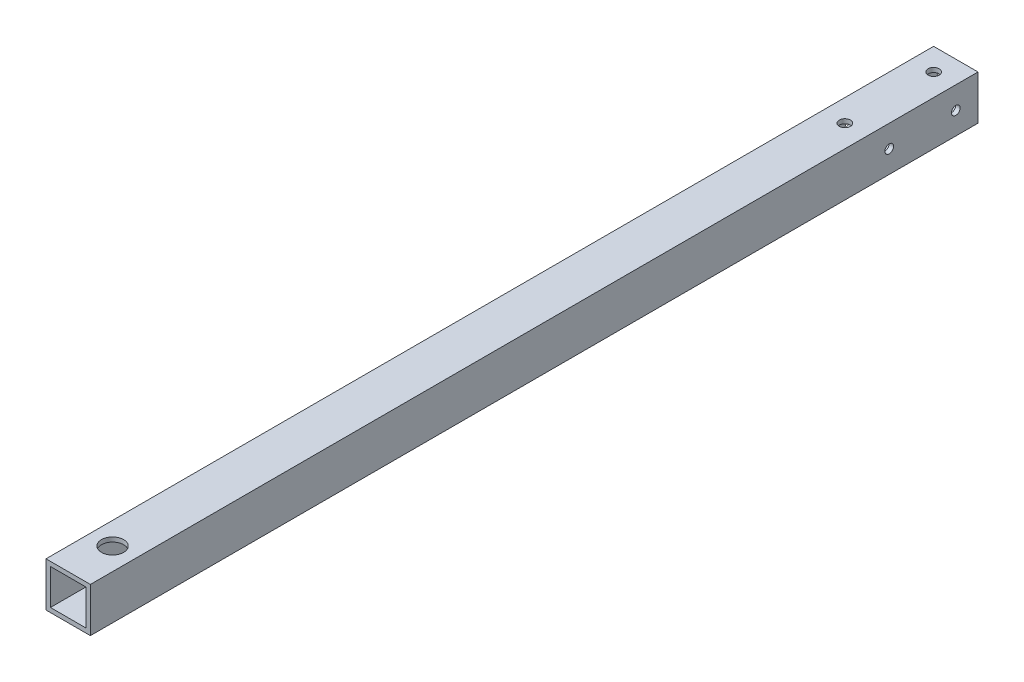
ISO-10303-21;
HEADER;
FILE_DESCRIPTION(('STEP AP214'),'2;1');
FILE_NAME('part.step','',(''),(''),'','','');
FILE_SCHEMA(('AUTOMOTIVE_DESIGN { 1 0 10303 214 1 1 1 1 }'));
ENDSEC;
DATA;
#1=APPLICATION_CONTEXT('core data for automotive mechanical design processes');
#2=APPLICATION_PROTOCOL_DEFINITION('international standard','automotive_design',2000,#1);
#3=PRODUCT_CONTEXT('',#1,'mechanical');
#4=PRODUCT('Part','Part','',(#3));
#5=PRODUCT_RELATED_PRODUCT_CATEGORY('part','',(#4));
#6=PRODUCT_DEFINITION_FORMATION('','',#4);
#7=PRODUCT_DEFINITION_CONTEXT('part definition',#1,'design');
#8=PRODUCT_DEFINITION('design','',#6,#7);
#9=PRODUCT_DEFINITION_SHAPE('','',#8);
#10=(LENGTH_UNIT() NAMED_UNIT(*) SI_UNIT(.MILLI.,.METRE.));
#11=(NAMED_UNIT(*) PLANE_ANGLE_UNIT() SI_UNIT($,.RADIAN.));
#12=(NAMED_UNIT(*) SI_UNIT($,.STERADIAN.) SOLID_ANGLE_UNIT());
#13=UNCERTAINTY_MEASURE_WITH_UNIT(LENGTH_MEASURE(1.E-05),#10,'distance_accuracy_value','');
#14=(GEOMETRIC_REPRESENTATION_CONTEXT(3) GLOBAL_UNCERTAINTY_ASSIGNED_CONTEXT((#13)) GLOBAL_UNIT_ASSIGNED_CONTEXT((#10,
#11,#12)) REPRESENTATION_CONTEXT('',''));
#15=CARTESIAN_POINT('',(0.,0.,0.));
#16=DIRECTION('',(0.,0.,1.));
#17=DIRECTION('',(1.,0.,0.));
#18=AXIS2_PLACEMENT_3D('',#15,#16,#17);
#19=CARTESIAN_POINT('',(-12.7,-12.7,254.));
#20=DIRECTION('',(-1.,0.,0.));
#21=DIRECTION('',(0.,0.,1.));
#22=AXIS2_PLACEMENT_3D('',#19,#20,#21);
#23=PLANE('',#22);
#24=CARTESIAN_POINT('',(-12.7,0.,-241.3));
#25=DIRECTION('',(-1.,0.,0.));
#26=DIRECTION('',(0.,0.,1.));
#27=AXIS2_PLACEMENT_3D('',#24,#25,#26);
#28=CIRCLE('',#27,2.4892);
#29=CARTESIAN_POINT('',(-12.7,0.,-238.8108));
#30=VERTEX_POINT('',#29);
#31=EDGE_CURVE('E208',#30,#30,#28,.T.);
#32=ORIENTED_EDGE('',*,*,#31,.F.);
#33=EDGE_LOOP('',(#32));
#34=FACE_BOUND('',#33,.T.);
#35=CARTESIAN_POINT('',(-12.7,0.,-203.2));
#36=DIRECTION('',(-1.,0.,0.));
#37=DIRECTION('',(0.,0.,1.));
#38=AXIS2_PLACEMENT_3D('',#35,#36,#37);
#39=CIRCLE('',#38,2.4892);
#40=CARTESIAN_POINT('',(-12.7,0.,-200.7108));
#41=VERTEX_POINT('',#40);
#42=EDGE_CURVE('E218',#41,#41,#39,.T.);
#43=ORIENTED_EDGE('',*,*,#42,.F.);
#44=EDGE_LOOP('',(#43));
#45=FACE_BOUND('',#44,.T.);
#46=DIRECTION('',(0.,1.,0.));
#47=VECTOR('',#46,1.);
#48=CARTESIAN_POINT('',(-12.7,-12.7,-254.));
#49=LINE('',#48,#47);
#50=CARTESIAN_POINT('',(-12.7,-12.7,-254.));
#51=VERTEX_POINT('',#50);
#52=CARTESIAN_POINT('',(-12.7,12.7,-254.));
#53=VERTEX_POINT('',#52);
#54=EDGE_CURVE('E157',#51,#53,#49,.T.);
#55=ORIENTED_EDGE('',*,*,#54,.F.);
#56=DIRECTION('',(0.,0.,-1.));
#57=VECTOR('',#56,1.);
#58=CARTESIAN_POINT('',(-12.7,-12.7,254.));
#59=LINE('',#58,#57);
#60=CARTESIAN_POINT('',(-12.7,-12.7,254.));
#61=VERTEX_POINT('',#60);
#62=EDGE_CURVE('E12',#61,#51,#59,.T.);
#63=ORIENTED_EDGE('',*,*,#62,.F.);
#64=DIRECTION('',(0.,1.,0.));
#65=VECTOR('',#64,1.);
#66=CARTESIAN_POINT('',(-12.7,-12.7,254.));
#67=LINE('',#66,#65);
#68=CARTESIAN_POINT('',(-12.7,12.7,254.));
#69=VERTEX_POINT('',#68);
#70=EDGE_CURVE('E161',#61,#69,#67,.T.);
#71=ORIENTED_EDGE('',*,*,#70,.T.);
#72=DIRECTION('',(0.,0.,-1.));
#73=VECTOR('',#72,1.);
#74=CARTESIAN_POINT('',(-12.7,12.7,254.));
#75=LINE('',#74,#73);
#76=EDGE_CURVE('E172',#69,#53,#75,.T.);
#77=ORIENTED_EDGE('',*,*,#76,.T.);
#78=EDGE_LOOP('',(#55,#63,#71,#77));
#79=FACE_BOUND('',#78,.T.);
#80=ADVANCED_FACE('F58',(#34,#45,#79),#23,.T.);
#81=CARTESIAN_POINT('',(-12.7,-12.7,254.));
#82=DIRECTION('',(0.,1.,0.));
#83=DIRECTION('',(0.,0.,1.));
#84=AXIS2_PLACEMENT_3D('',#81,#82,#83);
#85=PLANE('',#84);
#86=CARTESIAN_POINT('',(0.,-12.7,228.6));
#87=DIRECTION('',(0.,1.,0.));
#88=DIRECTION('',(0.,0.,1.));
#89=AXIS2_PLACEMENT_3D('',#86,#87,#88);
#90=CIRCLE('',#89,6.35);
#91=CARTESIAN_POINT('',(0.,-12.7,234.95));
#92=VERTEX_POINT('',#91);
#93=EDGE_CURVE('E198',#92,#92,#90,.T.);
#94=ORIENTED_EDGE('',*,*,#93,.T.);
#95=EDGE_LOOP('',(#94));
#96=FACE_BOUND('',#95,.T.);
#97=CARTESIAN_POINT('',(0.,-12.7,-241.3));
#98=DIRECTION('',(0.,1.,0.));
#99=DIRECTION('',(0.,0.,1.));
#100=AXIS2_PLACEMENT_3D('',#97,#98,#99);
#101=CIRCLE('',#100,3.175);
#102=CARTESIAN_POINT('',(0.,-12.7,-238.125));
#103=VERTEX_POINT('',#102);
#104=EDGE_CURVE('E191',#103,#103,#101,.T.);
#105=ORIENTED_EDGE('',*,*,#104,.T.);
#106=EDGE_LOOP('',(#105));
#107=FACE_BOUND('',#106,.T.);
#108=CARTESIAN_POINT('',(0.,-12.7,-190.5));
#109=DIRECTION('',(0.,1.,0.));
#110=DIRECTION('',(0.,0.,1.));
#111=AXIS2_PLACEMENT_3D('',#108,#109,#110);
#112=CIRCLE('',#111,3.175);
#113=CARTESIAN_POINT('',(0.,-12.7,-187.325));
#114=VERTEX_POINT('',#113);
#115=EDGE_CURVE('E237',#114,#114,#112,.T.);
#116=ORIENTED_EDGE('',*,*,#115,.T.);
#117=EDGE_LOOP('',(#116));
#118=FACE_BOUND('',#117,.T.);
#119=DIRECTION('',(1.,0.,0.));
#120=VECTOR('',#119,1.);
#121=CARTESIAN_POINT('',(-12.7,-12.7,-254.));
#122=LINE('',#121,#120);
#123=CARTESIAN_POINT('',(12.7,-12.7,-254.));
#124=VERTEX_POINT('',#123);
#125=EDGE_CURVE('E165',#51,#124,#122,.T.);
#126=ORIENTED_EDGE('',*,*,#125,.T.);
#127=DIRECTION('',(0.,0.,-1.));
#128=VECTOR('',#127,1.);
#129=CARTESIAN_POINT('',(12.7,-12.7,254.));
#130=LINE('',#129,#128);
#131=CARTESIAN_POINT('',(12.7,-12.7,254.));
#132=VERTEX_POINT('',#131);
#133=EDGE_CURVE('E66',#132,#124,#130,.T.);
#134=ORIENTED_EDGE('',*,*,#133,.F.);
#135=DIRECTION('',(1.,0.,0.));
#136=VECTOR('',#135,1.);
#137=CARTESIAN_POINT('',(-12.7,-12.7,254.));
#138=LINE('',#137,#136);
#139=EDGE_CURVE('E170',#61,#132,#138,.T.);
#140=ORIENTED_EDGE('',*,*,#139,.F.);
#141=ORIENTED_EDGE('',*,*,#62,.T.);
#142=EDGE_LOOP('',(#126,#134,#140,#141));
#143=FACE_BOUND('',#142,.T.);
#144=ADVANCED_FACE('F272',(#96,#107,#118,#143),#85,.F.);
#145=CARTESIAN_POINT('',(12.7,-12.7,254.));
#146=DIRECTION('',(-1.,0.,0.));
#147=DIRECTION('',(0.,0.,1.));
#148=AXIS2_PLACEMENT_3D('',#145,#146,#147);
#149=PLANE('',#148);
#150=CARTESIAN_POINT('',(12.7,0.,-241.3));
#151=DIRECTION('',(-1.,0.,0.));
#152=DIRECTION('',(0.,0.,1.));
#153=AXIS2_PLACEMENT_3D('',#150,#151,#152);
#154=CIRCLE('',#153,2.4892);
#155=CARTESIAN_POINT('',(12.7,0.,-238.8108));
#156=VERTEX_POINT('',#155);
#157=EDGE_CURVE('E202',#156,#156,#154,.T.);
#158=ORIENTED_EDGE('',*,*,#157,.T.);
#159=EDGE_LOOP('',(#158));
#160=FACE_BOUND('',#159,.T.);
#161=CARTESIAN_POINT('',(12.7,0.,-203.2));
#162=DIRECTION('',(-1.,0.,0.));
#163=DIRECTION('',(0.,0.,1.));
#164=AXIS2_PLACEMENT_3D('',#161,#162,#163);
#165=CIRCLE('',#164,2.4892);
#166=CARTESIAN_POINT('',(12.7,0.,-200.7108));
#167=VERTEX_POINT('',#166);
#168=EDGE_CURVE('E213',#167,#167,#165,.T.);
#169=ORIENTED_EDGE('',*,*,#168,.T.);
#170=EDGE_LOOP('',(#169));
#171=FACE_BOUND('',#170,.T.);
#172=DIRECTION('',(0.,1.,0.));
#173=VECTOR('',#172,1.);
#174=CARTESIAN_POINT('',(12.7,-12.7,-254.));
#175=LINE('',#174,#173);
#176=CARTESIAN_POINT('',(12.7,12.7,-254.));
#177=VERTEX_POINT('',#176);
#178=EDGE_CURVE('E178',#124,#177,#175,.T.);
#179=ORIENTED_EDGE('',*,*,#178,.T.);
#180=DIRECTION('',(0.,0.,-1.));
#181=VECTOR('',#180,1.);
#182=CARTESIAN_POINT('',(12.7,12.7,254.));
#183=LINE('',#182,#181);
#184=CARTESIAN_POINT('',(12.7,12.7,254.));
#185=VERTEX_POINT('',#184);
#186=EDGE_CURVE('E184',#185,#177,#183,.T.);
#187=ORIENTED_EDGE('',*,*,#186,.F.);
#188=DIRECTION('',(0.,1.,0.));
#189=VECTOR('',#188,1.);
#190=CARTESIAN_POINT('',(12.7,-12.7,254.));
#191=LINE('',#190,#189);
#192=EDGE_CURVE('E168',#132,#185,#191,.T.);
#193=ORIENTED_EDGE('',*,*,#192,.F.);
#194=ORIENTED_EDGE('',*,*,#133,.T.);
#195=EDGE_LOOP('',(#179,#187,#193,#194));
#196=FACE_BOUND('',#195,.T.);
#197=ADVANCED_FACE('F277',(#160,#171,#196),#149,.F.);
#198=CARTESIAN_POINT('',(-12.7,12.7,254.));
#199=DIRECTION('',(0.,1.,0.));
#200=DIRECTION('',(0.,0.,1.));
#201=AXIS2_PLACEMENT_3D('',#198,#199,#200);
#202=PLANE('',#201);
#203=CARTESIAN_POINT('',(0.,12.7,228.6));
#204=DIRECTION('',(0.,1.,0.));
#205=DIRECTION('',(0.,0.,1.));
#206=AXIS2_PLACEMENT_3D('',#203,#204,#205);
#207=CIRCLE('',#206,6.35);
#208=CARTESIAN_POINT('',(0.,12.7,234.95));
#209=VERTEX_POINT('',#208);
#210=EDGE_CURVE('E224',#209,#209,#207,.T.);
#211=ORIENTED_EDGE('',*,*,#210,.F.);
#212=EDGE_LOOP('',(#211));
#213=FACE_BOUND('',#212,.T.);
#214=CARTESIAN_POINT('',(0.,12.7,-241.3));
#215=DIRECTION('',(0.,1.,0.));
#216=DIRECTION('',(0.,0.,1.));
#217=AXIS2_PLACEMENT_3D('',#214,#215,#216);
#218=CIRCLE('',#217,3.175);
#219=CARTESIAN_POINT('',(0.,12.7,-238.125));
#220=VERTEX_POINT('',#219);
#221=EDGE_CURVE('E234',#220,#220,#218,.T.);
#222=ORIENTED_EDGE('',*,*,#221,.F.);
#223=EDGE_LOOP('',(#222));
#224=FACE_BOUND('',#223,.T.);
#225=CARTESIAN_POINT('',(0.,12.7,-190.5));
#226=DIRECTION('',(0.,1.,0.));
#227=DIRECTION('',(0.,0.,1.));
#228=AXIS2_PLACEMENT_3D('',#225,#226,#227);
#229=CIRCLE('',#228,3.175);
#230=CARTESIAN_POINT('',(0.,12.7,-187.325));
#231=VERTEX_POINT('',#230);
#232=EDGE_CURVE('E231',#231,#231,#229,.T.);
#233=ORIENTED_EDGE('',*,*,#232,.F.);
#234=EDGE_LOOP('',(#233));
#235=FACE_BOUND('',#234,.T.);
#236=DIRECTION('',(1.,0.,0.));
#237=VECTOR('',#236,1.);
#238=CARTESIAN_POINT('',(-12.7,12.7,-254.));
#239=LINE('',#238,#237);
#240=EDGE_CURVE('E175',#53,#177,#239,.T.);
#241=ORIENTED_EDGE('',*,*,#240,.F.);
#242=ORIENTED_EDGE('',*,*,#76,.F.);
#243=DIRECTION('',(1.,0.,0.));
#244=VECTOR('',#243,1.);
#245=CARTESIAN_POINT('',(-12.7,12.7,254.));
#246=LINE('',#245,#244);
#247=EDGE_CURVE('E164',#69,#185,#246,.T.);
#248=ORIENTED_EDGE('',*,*,#247,.T.);
#249=ORIENTED_EDGE('',*,*,#186,.T.);
#250=EDGE_LOOP('',(#241,#242,#248,#249));
#251=FACE_BOUND('',#250,.T.);
#252=ADVANCED_FACE('F297',(#213,#224,#235,#251),#202,.T.);
#253=CARTESIAN_POINT('',(0.,0.,254.));
#254=DIRECTION('',(0.,0.,-1.));
#255=DIRECTION('',(-1.,0.,0.));
#256=AXIS2_PLACEMENT_3D('',#253,#254,#255);
#257=PLANE('',#256);
#258=DIRECTION('',(1.,0.,0.));
#259=VECTOR('',#258,1.);
#260=CARTESIAN_POINT('',(0.,-10.16,254.));
#261=LINE('',#260,#259);
#262=CARTESIAN_POINT('',(-10.16,-10.16,254.));
#263=VERTEX_POINT('',#262);
#264=CARTESIAN_POINT('',(10.16,-10.16,254.));
#265=VERTEX_POINT('',#264);
#266=EDGE_CURVE('E128',#263,#265,#261,.T.);
#267=ORIENTED_EDGE('',*,*,#266,.F.);
#268=DIRECTION('',(0.,1.,0.));
#269=VECTOR('',#268,1.);
#270=CARTESIAN_POINT('',(-10.16,0.,254.));
#271=LINE('',#270,#269);
#272=CARTESIAN_POINT('',(-10.16,10.16,254.));
#273=VERTEX_POINT('',#272);
#274=EDGE_CURVE('E125',#263,#273,#271,.T.);
#275=ORIENTED_EDGE('',*,*,#274,.T.);
#276=DIRECTION('',(1.,0.,0.));
#277=VECTOR('',#276,1.);
#278=CARTESIAN_POINT('',(0.,10.16,254.));
#279=LINE('',#278,#277);
#280=CARTESIAN_POINT('',(10.16,10.16,254.));
#281=VERTEX_POINT('',#280);
#282=EDGE_CURVE('E131',#273,#281,#279,.T.);
#283=ORIENTED_EDGE('',*,*,#282,.T.);
#284=DIRECTION('',(0.,1.,0.));
#285=VECTOR('',#284,1.);
#286=CARTESIAN_POINT('',(10.16,0.,254.));
#287=LINE('',#286,#285);
#288=EDGE_CURVE('E135',#265,#281,#287,.T.);
#289=ORIENTED_EDGE('',*,*,#288,.F.);
#290=EDGE_LOOP('',(#267,#275,#283,#289));
#291=FACE_BOUND('',#290,.T.);
#292=ORIENTED_EDGE('',*,*,#70,.F.);
#293=ORIENTED_EDGE('',*,*,#139,.T.);
#294=ORIENTED_EDGE('',*,*,#192,.T.);
#295=ORIENTED_EDGE('',*,*,#247,.F.);
#296=EDGE_LOOP('',(#292,#293,#294,#295));
#297=FACE_BOUND('',#296,.T.);
#298=ADVANCED_FACE('F137',(#291,#297),#257,.F.);
#299=CARTESIAN_POINT('',(0.,0.,-254.));
#300=DIRECTION('',(0.,0.,-1.));
#301=DIRECTION('',(-1.,0.,0.));
#302=AXIS2_PLACEMENT_3D('',#299,#300,#301);
#303=PLANE('',#302);
#304=DIRECTION('',(0.,1.,0.));
#305=VECTOR('',#304,1.);
#306=CARTESIAN_POINT('',(-10.16,0.,-254.));
#307=LINE('',#306,#305);
#308=CARTESIAN_POINT('',(-10.16,-10.16,-254.));
#309=VERTEX_POINT('',#308);
#310=CARTESIAN_POINT('',(-10.16,10.16,-254.));
#311=VERTEX_POINT('',#310);
#312=EDGE_CURVE('E82',#309,#311,#307,.T.);
#313=ORIENTED_EDGE('',*,*,#312,.F.);
#314=DIRECTION('',(1.,0.,0.));
#315=VECTOR('',#314,1.);
#316=CARTESIAN_POINT('',(0.,-10.16,-254.));
#317=LINE('',#316,#315);
#318=CARTESIAN_POINT('',(10.16,-10.16,-254.));
#319=VERTEX_POINT('',#318);
#320=EDGE_CURVE('E139',#309,#319,#317,.T.);
#321=ORIENTED_EDGE('',*,*,#320,.T.);
#322=DIRECTION('',(0.,1.,0.));
#323=VECTOR('',#322,1.);
#324=CARTESIAN_POINT('',(10.16,0.,-254.));
#325=LINE('',#324,#323);
#326=CARTESIAN_POINT('',(10.16,10.16,-254.));
#327=VERTEX_POINT('',#326);
#328=EDGE_CURVE('E142',#319,#327,#325,.T.);
#329=ORIENTED_EDGE('',*,*,#328,.T.);
#330=DIRECTION('',(1.,0.,0.));
#331=VECTOR('',#330,1.);
#332=CARTESIAN_POINT('',(0.,10.16,-254.));
#333=LINE('',#332,#331);
#334=EDGE_CURVE('E151',#311,#327,#333,.T.);
#335=ORIENTED_EDGE('',*,*,#334,.F.);
#336=EDGE_LOOP('',(#313,#321,#329,#335));
#337=FACE_BOUND('',#336,.T.);
#338=ORIENTED_EDGE('',*,*,#54,.T.);
#339=ORIENTED_EDGE('',*,*,#240,.T.);
#340=ORIENTED_EDGE('',*,*,#178,.F.);
#341=ORIENTED_EDGE('',*,*,#125,.F.);
#342=EDGE_LOOP('',(#338,#339,#340,#341));
#343=FACE_BOUND('',#342,.T.);
#344=ADVANCED_FACE('F257',(#337,#343),#303,.T.);
#345=CARTESIAN_POINT('',(-10.16,0.,254.));
#346=DIRECTION('',(-1.,0.,0.));
#347=DIRECTION('',(0.,0.,1.));
#348=AXIS2_PLACEMENT_3D('',#345,#346,#347);
#349=PLANE('',#348);
#350=CARTESIAN_POINT('',(-10.16,0.,-241.3));
#351=DIRECTION('',(-1.,0.,0.));
#352=DIRECTION('',(0.,0.,1.));
#353=AXIS2_PLACEMENT_3D('',#350,#351,#352);
#354=CIRCLE('',#353,2.4892);
#355=CARTESIAN_POINT('',(-10.16,0.,-238.8108));
#356=VERTEX_POINT('',#355);
#357=EDGE_CURVE('E221',#356,#356,#354,.T.);
#358=ORIENTED_EDGE('',*,*,#357,.T.);
#359=EDGE_LOOP('',(#358));
#360=FACE_BOUND('',#359,.T.);
#361=CARTESIAN_POINT('',(-10.16,0.,-203.2));
#362=DIRECTION('',(-1.,0.,0.));
#363=DIRECTION('',(0.,0.,1.));
#364=AXIS2_PLACEMENT_3D('',#361,#362,#363);
#365=CIRCLE('',#364,2.4892);
#366=CARTESIAN_POINT('',(-10.16,0.,-200.7108));
#367=VERTEX_POINT('',#366);
#368=EDGE_CURVE('E201',#367,#367,#365,.T.);
#369=ORIENTED_EDGE('',*,*,#368,.T.);
#370=EDGE_LOOP('',(#369));
#371=FACE_BOUND('',#370,.T.);
#372=ORIENTED_EDGE('',*,*,#312,.T.);
#373=DIRECTION('',(0.,0.,-1.));
#374=VECTOR('',#373,1.);
#375=CARTESIAN_POINT('',(-10.16,10.16,254.));
#376=LINE('',#375,#374);
#377=EDGE_CURVE('E122',#273,#311,#376,.T.);
#378=ORIENTED_EDGE('',*,*,#377,.F.);
#379=ORIENTED_EDGE('',*,*,#274,.F.);
#380=DIRECTION('',(0.,0.,-1.));
#381=VECTOR('',#380,1.);
#382=CARTESIAN_POINT('',(-10.16,-10.16,254.));
#383=LINE('',#382,#381);
#384=EDGE_CURVE('E155',#263,#309,#383,.T.);
#385=ORIENTED_EDGE('',*,*,#384,.T.);
#386=EDGE_LOOP('',(#372,#378,#379,#385));
#387=FACE_BOUND('',#386,.T.);
#388=ADVANCED_FACE('F123',(#360,#371,#387),#349,.F.);
#389=CARTESIAN_POINT('',(0.,-10.16,254.));
#390=DIRECTION('',(0.,1.,0.));
#391=DIRECTION('',(0.,0.,1.));
#392=AXIS2_PLACEMENT_3D('',#389,#390,#391);
#393=PLANE('',#392);
#394=CARTESIAN_POINT('',(0.,-10.16,228.6));
#395=DIRECTION('',(0.,1.,0.));
#396=DIRECTION('',(0.,0.,1.));
#397=AXIS2_PLACEMENT_3D('',#394,#395,#396);
#398=CIRCLE('',#397,6.35);
#399=CARTESIAN_POINT('',(0.,-10.16,234.95));
#400=VERTEX_POINT('',#399);
#401=EDGE_CURVE('E197',#400,#400,#398,.T.);
#402=ORIENTED_EDGE('',*,*,#401,.F.);
#403=EDGE_LOOP('',(#402));
#404=FACE_BOUND('',#403,.T.);
#405=CARTESIAN_POINT('',(0.,-10.16,-241.3));
#406=DIRECTION('',(0.,1.,0.));
#407=DIRECTION('',(0.,0.,1.));
#408=AXIS2_PLACEMENT_3D('',#405,#406,#407);
#409=CIRCLE('',#408,3.175);
#410=CARTESIAN_POINT('',(0.,-10.16,-238.125));
#411=VERTEX_POINT('',#410);
#412=EDGE_CURVE('E145',#411,#411,#409,.T.);
#413=ORIENTED_EDGE('',*,*,#412,.F.);
#414=EDGE_LOOP('',(#413));
#415=FACE_BOUND('',#414,.T.);
#416=CARTESIAN_POINT('',(0.,-10.16,-190.5));
#417=DIRECTION('',(0.,1.,0.));
#418=DIRECTION('',(0.,0.,1.));
#419=AXIS2_PLACEMENT_3D('',#416,#417,#418);
#420=CIRCLE('',#419,3.175);
#421=CARTESIAN_POINT('',(0.,-10.16,-187.325));
#422=VERTEX_POINT('',#421);
#423=EDGE_CURVE('E190',#422,#422,#420,.T.);
#424=ORIENTED_EDGE('',*,*,#423,.F.);
#425=EDGE_LOOP('',(#424));
#426=FACE_BOUND('',#425,.T.);
#427=ORIENTED_EDGE('',*,*,#320,.F.);
#428=ORIENTED_EDGE('',*,*,#384,.F.);
#429=ORIENTED_EDGE('',*,*,#266,.T.);
#430=DIRECTION('',(0.,0.,-1.));
#431=VECTOR('',#430,1.);
#432=CARTESIAN_POINT('',(10.16,-10.16,254.));
#433=LINE('',#432,#431);
#434=EDGE_CURVE('E158',#265,#319,#433,.T.);
#435=ORIENTED_EDGE('',*,*,#434,.T.);
#436=EDGE_LOOP('',(#427,#428,#429,#435));
#437=FACE_BOUND('',#436,.T.);
#438=ADVANCED_FACE('F247',(#404,#415,#426,#437),#393,.T.);
#439=CARTESIAN_POINT('',(10.16,0.,254.));
#440=DIRECTION('',(-1.,0.,0.));
#441=DIRECTION('',(0.,0.,1.));
#442=AXIS2_PLACEMENT_3D('',#439,#440,#441);
#443=PLANE('',#442);
#444=CARTESIAN_POINT('',(10.16,0.,-241.3));
#445=DIRECTION('',(-1.,0.,0.));
#446=DIRECTION('',(0.,0.,1.));
#447=AXIS2_PLACEMENT_3D('',#444,#445,#446);
#448=CIRCLE('',#447,2.4892);
#449=CARTESIAN_POINT('',(10.16,0.,-238.8108));
#450=VERTEX_POINT('',#449);
#451=EDGE_CURVE('E61',#450,#450,#448,.T.);
#452=ORIENTED_EDGE('',*,*,#451,.F.);
#453=EDGE_LOOP('',(#452));
#454=FACE_BOUND('',#453,.T.);
#455=CARTESIAN_POINT('',(10.16,0.,-203.2));
#456=DIRECTION('',(-1.,0.,0.));
#457=DIRECTION('',(0.,0.,1.));
#458=AXIS2_PLACEMENT_3D('',#455,#456,#457);
#459=CIRCLE('',#458,2.4892);
#460=CARTESIAN_POINT('',(10.16,0.,-200.7108));
#461=VERTEX_POINT('',#460);
#462=EDGE_CURVE('E199',#461,#461,#459,.T.);
#463=ORIENTED_EDGE('',*,*,#462,.F.);
#464=EDGE_LOOP('',(#463));
#465=FACE_BOUND('',#464,.T.);
#466=ORIENTED_EDGE('',*,*,#328,.F.);
#467=ORIENTED_EDGE('',*,*,#434,.F.);
#468=ORIENTED_EDGE('',*,*,#288,.T.);
#469=DIRECTION('',(0.,0.,-1.));
#470=VECTOR('',#469,1.);
#471=CARTESIAN_POINT('',(10.16,10.16,254.));
#472=LINE('',#471,#470);
#473=EDGE_CURVE('E74',#281,#327,#472,.T.);
#474=ORIENTED_EDGE('',*,*,#473,.T.);
#475=EDGE_LOOP('',(#466,#467,#468,#474));
#476=FACE_BOUND('',#475,.T.);
#477=ADVANCED_FACE('F250',(#454,#465,#476),#443,.T.);
#478=CARTESIAN_POINT('',(0.,10.16,254.));
#479=DIRECTION('',(0.,1.,0.));
#480=DIRECTION('',(0.,0.,1.));
#481=AXIS2_PLACEMENT_3D('',#478,#479,#480);
#482=PLANE('',#481);
#483=CARTESIAN_POINT('',(0.,10.16,228.6));
#484=DIRECTION('',(0.,1.,0.));
#485=DIRECTION('',(0.,0.,1.));
#486=AXIS2_PLACEMENT_3D('',#483,#484,#485);
#487=CIRCLE('',#486,6.35);
#488=CARTESIAN_POINT('',(0.,10.16,234.95));
#489=VERTEX_POINT('',#488);
#490=EDGE_CURVE('E195',#489,#489,#487,.T.);
#491=ORIENTED_EDGE('',*,*,#490,.T.);
#492=EDGE_LOOP('',(#491));
#493=FACE_BOUND('',#492,.T.);
#494=CARTESIAN_POINT('',(0.,10.16,-241.3));
#495=DIRECTION('',(0.,1.,0.));
#496=DIRECTION('',(0.,0.,1.));
#497=AXIS2_PLACEMENT_3D('',#494,#495,#496);
#498=CIRCLE('',#497,3.175);
#499=CARTESIAN_POINT('',(0.,10.16,-238.125));
#500=VERTEX_POINT('',#499);
#501=EDGE_CURVE('E192',#500,#500,#498,.T.);
#502=ORIENTED_EDGE('',*,*,#501,.T.);
#503=EDGE_LOOP('',(#502));
#504=FACE_BOUND('',#503,.T.);
#505=CARTESIAN_POINT('',(0.,10.16,-190.5));
#506=DIRECTION('',(0.,1.,0.));
#507=DIRECTION('',(0.,0.,1.));
#508=AXIS2_PLACEMENT_3D('',#505,#506,#507);
#509=CIRCLE('',#508,3.175);
#510=CARTESIAN_POINT('',(0.,10.16,-187.325));
#511=VERTEX_POINT('',#510);
#512=EDGE_CURVE('E187',#511,#511,#509,.T.);
#513=ORIENTED_EDGE('',*,*,#512,.T.);
#514=EDGE_LOOP('',(#513));
#515=FACE_BOUND('',#514,.T.);
#516=ORIENTED_EDGE('',*,*,#334,.T.);
#517=ORIENTED_EDGE('',*,*,#473,.F.);
#518=ORIENTED_EDGE('',*,*,#282,.F.);
#519=ORIENTED_EDGE('',*,*,#377,.T.);
#520=EDGE_LOOP('',(#516,#517,#518,#519));
#521=FACE_BOUND('',#520,.T.);
#522=ADVANCED_FACE('F132',(#493,#504,#515,#521),#482,.F.);
#523=CARTESIAN_POINT('',(0.,-12.7,-190.5));
#524=DIRECTION('',(0.,1.,0.));
#525=DIRECTION('',(0.,0.,1.));
#526=AXIS2_PLACEMENT_3D('',#523,#524,#525);
#527=CYLINDRICAL_SURFACE('',#526,3.175);
#528=ORIENTED_EDGE('',*,*,#232,.T.);
#529=EDGE_LOOP('',(#528));
#530=FACE_BOUND('',#529,.T.);
#531=ORIENTED_EDGE('',*,*,#512,.F.);
#532=EDGE_LOOP('',(#531));
#533=FACE_BOUND('',#532,.T.);
#534=ADVANCED_FACE('F266',(#530,#533),#527,.F.);
#535=CARTESIAN_POINT('',(0.,-12.7,-241.3));
#536=DIRECTION('',(0.,1.,0.));
#537=DIRECTION('',(0.,0.,1.));
#538=AXIS2_PLACEMENT_3D('',#535,#536,#537);
#539=CYLINDRICAL_SURFACE('',#538,3.175);
#540=ORIENTED_EDGE('',*,*,#221,.T.);
#541=EDGE_LOOP('',(#540));
#542=FACE_BOUND('',#541,.T.);
#543=ORIENTED_EDGE('',*,*,#501,.F.);
#544=EDGE_LOOP('',(#543));
#545=FACE_BOUND('',#544,.T.);
#546=ADVANCED_FACE('F354',(#542,#545),#539,.F.);
#547=ORIENTED_EDGE('',*,*,#423,.T.);
#548=EDGE_LOOP('',(#547));
#549=FACE_BOUND('',#548,.T.);
#550=ORIENTED_EDGE('',*,*,#115,.F.);
#551=EDGE_LOOP('',(#550));
#552=FACE_BOUND('',#551,.T.);
#553=ADVANCED_FACE('F244',(#549,#552),#527,.F.);
#554=ORIENTED_EDGE('',*,*,#412,.T.);
#555=EDGE_LOOP('',(#554));
#556=FACE_BOUND('',#555,.T.);
#557=ORIENTED_EDGE('',*,*,#104,.F.);
#558=EDGE_LOOP('',(#557));
#559=FACE_BOUND('',#558,.T.);
#560=ADVANCED_FACE('F347',(#556,#559),#539,.F.);
#561=CARTESIAN_POINT('',(0.,-12.7,228.6));
#562=DIRECTION('',(0.,1.,0.));
#563=DIRECTION('',(0.,0.,1.));
#564=AXIS2_PLACEMENT_3D('',#561,#562,#563);
#565=CYLINDRICAL_SURFACE('',#564,6.35);
#566=ORIENTED_EDGE('',*,*,#210,.T.);
#567=EDGE_LOOP('',(#566));
#568=FACE_BOUND('',#567,.T.);
#569=ORIENTED_EDGE('',*,*,#490,.F.);
#570=EDGE_LOOP('',(#569));
#571=FACE_BOUND('',#570,.T.);
#572=ADVANCED_FACE('F339',(#568,#571),#565,.F.);
#573=ORIENTED_EDGE('',*,*,#401,.T.);
#574=EDGE_LOOP('',(#573));
#575=FACE_BOUND('',#574,.T.);
#576=ORIENTED_EDGE('',*,*,#93,.F.);
#577=EDGE_LOOP('',(#576));
#578=FACE_BOUND('',#577,.T.);
#579=ADVANCED_FACE('F335',(#575,#578),#565,.F.);
#580=CARTESIAN_POINT('',(12.7,0.,-203.2));
#581=DIRECTION('',(-1.,0.,0.));
#582=DIRECTION('',(0.,0.,1.));
#583=AXIS2_PLACEMENT_3D('',#580,#581,#582);
#584=CYLINDRICAL_SURFACE('',#583,2.4892);
#585=ORIENTED_EDGE('',*,*,#462,.T.);
#586=EDGE_LOOP('',(#585));
#587=FACE_BOUND('',#586,.T.);
#588=ORIENTED_EDGE('',*,*,#168,.F.);
#589=EDGE_LOOP('',(#588));
#590=FACE_BOUND('',#589,.T.);
#591=ADVANCED_FACE('F325',(#587,#590),#584,.F.);
#592=CARTESIAN_POINT('',(12.7,0.,-241.3));
#593=DIRECTION('',(-1.,0.,0.));
#594=DIRECTION('',(0.,0.,1.));
#595=AXIS2_PLACEMENT_3D('',#592,#593,#594);
#596=CYLINDRICAL_SURFACE('',#595,2.4892);
#597=ORIENTED_EDGE('',*,*,#451,.T.);
#598=EDGE_LOOP('',(#597));
#599=FACE_BOUND('',#598,.T.);
#600=ORIENTED_EDGE('',*,*,#157,.F.);
#601=EDGE_LOOP('',(#600));
#602=FACE_BOUND('',#601,.T.);
#603=ADVANCED_FACE('F322',(#599,#602),#596,.F.);
#604=ORIENTED_EDGE('',*,*,#42,.T.);
#605=EDGE_LOOP('',(#604));
#606=FACE_BOUND('',#605,.T.);
#607=ORIENTED_EDGE('',*,*,#368,.F.);
#608=EDGE_LOOP('',(#607));
#609=FACE_BOUND('',#608,.T.);
#610=ADVANCED_FACE('F319',(#606,#609),#584,.F.);
#611=ORIENTED_EDGE('',*,*,#31,.T.);
#612=EDGE_LOOP('',(#611));
#613=FACE_BOUND('',#612,.T.);
#614=ORIENTED_EDGE('',*,*,#357,.F.);
#615=EDGE_LOOP('',(#614));
#616=FACE_BOUND('',#615,.T.);
#617=ADVANCED_FACE('F321',(#613,#616),#596,.F.);
#618=CLOSED_SHELL('',(#80,#144,#197,#252,#298,#344,#388,#438,#477,#522,#534,#546,#553,#560,#572,
#579,#591,#603,#610,#617));
#619=MANIFOLD_SOLID_BREP('B2',#618);
#620=ADVANCED_BREP_SHAPE_REPRESENTATION('',(#18,#619),#14);
#621=SHAPE_DEFINITION_REPRESENTATION(#9,#620);
ENDSEC;
END-ISO-10303-21;
